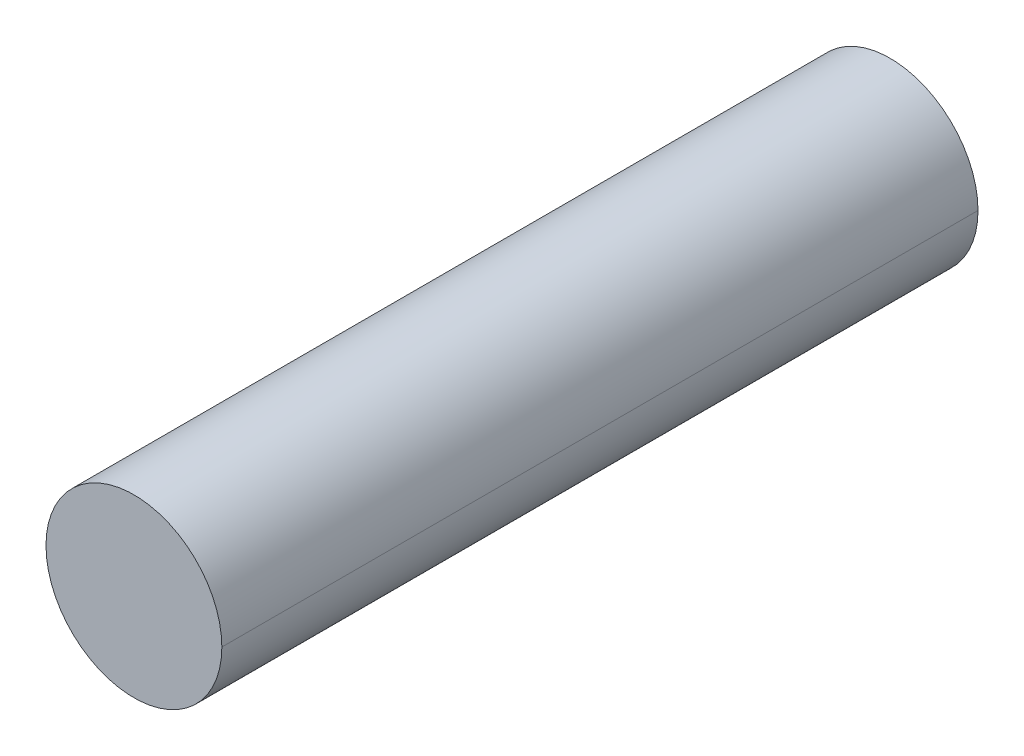
ISO-10303-21;
HEADER;
FILE_DESCRIPTION(('STEP AP214'),'2;1');
FILE_NAME('part.step','',(''),(''),'','','');
FILE_SCHEMA(('AUTOMOTIVE_DESIGN { 1 0 10303 214 1 1 1 1 }'));
ENDSEC;
DATA;
#1=APPLICATION_CONTEXT('core data for automotive mechanical design processes');
#2=APPLICATION_PROTOCOL_DEFINITION('international standard','automotive_design',2000,#1);
#3=PRODUCT_CONTEXT('',#1,'mechanical');
#4=PRODUCT('Part','Part','',(#3));
#5=PRODUCT_RELATED_PRODUCT_CATEGORY('part','',(#4));
#6=PRODUCT_DEFINITION_FORMATION('','',#4);
#7=PRODUCT_DEFINITION_CONTEXT('part definition',#1,'design');
#8=PRODUCT_DEFINITION('design','',#6,#7);
#9=PRODUCT_DEFINITION_SHAPE('','',#8);
#10=(LENGTH_UNIT() NAMED_UNIT(*) SI_UNIT(.MILLI.,.METRE.));
#11=(NAMED_UNIT(*) PLANE_ANGLE_UNIT() SI_UNIT($,.RADIAN.));
#12=(NAMED_UNIT(*) SI_UNIT($,.STERADIAN.) SOLID_ANGLE_UNIT());
#13=UNCERTAINTY_MEASURE_WITH_UNIT(LENGTH_MEASURE(1.E-05),#10,'distance_accuracy_value','');
#14=(GEOMETRIC_REPRESENTATION_CONTEXT(3) GLOBAL_UNCERTAINTY_ASSIGNED_CONTEXT((#13)) GLOBAL_UNIT_ASSIGNED_CONTEXT((#10,
#11,#12)) REPRESENTATION_CONTEXT('',''));
#15=CARTESIAN_POINT('',(0.,0.,0.));
#16=DIRECTION('',(0.,0.,1.));
#17=DIRECTION('',(1.,0.,0.));
#18=AXIS2_PLACEMENT_3D('',#15,#16,#17);
#19=CARTESIAN_POINT('',(0.,0.,0.));
#20=DIRECTION('',(0.,0.,1.));
#21=DIRECTION('',(1.,0.,0.));
#22=AXIS2_PLACEMENT_3D('',#19,#20,#21);
#23=PLANE('',#22);
#24=CARTESIAN_POINT('',(0.,0.,0.));
#25=DIRECTION('',(0.,0.,1.));
#26=DIRECTION('',(1.,0.,0.));
#27=AXIS2_PLACEMENT_3D('',#24,#25,#26);
#28=CIRCLE('',#27,5.);
#29=CARTESIAN_POINT('',(-5.,0.,0.));
#30=VERTEX_POINT('',#29);
#31=CARTESIAN_POINT('',(5.,0.,0.));
#32=VERTEX_POINT('',#31);
#33=EDGE_CURVE('E9',#30,#32,#28,.T.);
#34=ORIENTED_EDGE('',*,*,#33,.F.);
#35=CARTESIAN_POINT('',(0.,0.,0.));
#36=DIRECTION('',(0.,0.,1.));
#37=DIRECTION('',(1.,0.,0.));
#38=AXIS2_PLACEMENT_3D('',#35,#36,#37);
#39=CIRCLE('',#38,5.);
#40=EDGE_CURVE('E63',#32,#30,#39,.T.);
#41=ORIENTED_EDGE('',*,*,#40,.F.);
#42=EDGE_LOOP('',(#34,#41));
#43=FACE_BOUND('',#42,.T.);
#44=ADVANCED_FACE('F14',(#43),#23,.F.);
#45=CARTESIAN_POINT('',(0.,0.,43.));
#46=DIRECTION('',(0.,0.,1.));
#47=DIRECTION('',(1.,0.,0.));
#48=AXIS2_PLACEMENT_3D('',#45,#46,#47);
#49=PLANE('',#48);
#50=CARTESIAN_POINT('',(0.,0.,43.));
#51=DIRECTION('',(0.,0.,1.));
#52=DIRECTION('',(1.,0.,0.));
#53=AXIS2_PLACEMENT_3D('',#50,#51,#52);
#54=CIRCLE('',#53,5.);
#55=CARTESIAN_POINT('',(-5.,0.,43.));
#56=VERTEX_POINT('',#55);
#57=CARTESIAN_POINT('',(5.,0.,43.));
#58=VERTEX_POINT('',#57);
#59=EDGE_CURVE('E24',#56,#58,#54,.T.);
#60=ORIENTED_EDGE('',*,*,#59,.T.);
#61=CARTESIAN_POINT('',(0.,0.,43.));
#62=DIRECTION('',(0.,0.,1.));
#63=DIRECTION('',(1.,0.,0.));
#64=AXIS2_PLACEMENT_3D('',#61,#62,#63);
#65=CIRCLE('',#64,5.);
#66=EDGE_CURVE('E62',#58,#56,#65,.T.);
#67=ORIENTED_EDGE('',*,*,#66,.T.);
#68=EDGE_LOOP('',(#60,#67));
#69=FACE_BOUND('',#68,.T.);
#70=ADVANCED_FACE('F66',(#69),#49,.T.);
#71=CARTESIAN_POINT('',(0.,0.,43.));
#72=DIRECTION('',(0.,0.,-1.));
#73=DIRECTION('',(-1.,0.,0.));
#74=AXIS2_PLACEMENT_3D('',#71,#72,#73);
#75=CYLINDRICAL_SURFACE('',#74,5.);
#76=DIRECTION('',(0.,0.,-1.));
#77=VECTOR('',#76,1.);
#78=CARTESIAN_POINT('',(5.,0.,43.));
#79=LINE('',#78,#77);
#80=EDGE_CURVE('E56',#58,#32,#79,.T.);
#81=ORIENTED_EDGE('',*,*,#80,.F.);
#82=ORIENTED_EDGE('',*,*,#59,.F.);
#83=DIRECTION('',(0.,0.,-1.));
#84=VECTOR('',#83,1.);
#85=CARTESIAN_POINT('',(-5.,0.,43.));
#86=LINE('',#85,#84);
#87=EDGE_CURVE('E53',#56,#30,#86,.T.);
#88=ORIENTED_EDGE('',*,*,#87,.T.);
#89=ORIENTED_EDGE('',*,*,#33,.T.);
#90=EDGE_LOOP('',(#81,#82,#88,#89));
#91=FACE_BOUND('',#90,.T.);
#92=ADVANCED_FACE('F16',(#91),#75,.T.);
#93=CARTESIAN_POINT('',(0.,0.,43.));
#94=DIRECTION('',(0.,0.,-1.));
#95=DIRECTION('',(-1.,0.,0.));
#96=AXIS2_PLACEMENT_3D('',#93,#94,#95);
#97=CYLINDRICAL_SURFACE('',#96,5.);
#98=ORIENTED_EDGE('',*,*,#66,.F.);
#99=ORIENTED_EDGE('',*,*,#80,.T.);
#100=ORIENTED_EDGE('',*,*,#40,.T.);
#101=ORIENTED_EDGE('',*,*,#87,.F.);
#102=EDGE_LOOP('',(#98,#99,#100,#101));
#103=FACE_BOUND('',#102,.T.);
#104=ADVANCED_FACE('F61',(#103),#97,.T.);
#105=CLOSED_SHELL('',(#44,#70,#92,#104));
#106=MANIFOLD_SOLID_BREP('B1',#105);
#107=ADVANCED_BREP_SHAPE_REPRESENTATION('',(#18,#106),#14);
#108=SHAPE_DEFINITION_REPRESENTATION(#9,#107);
ENDSEC;
END-ISO-10303-21;
